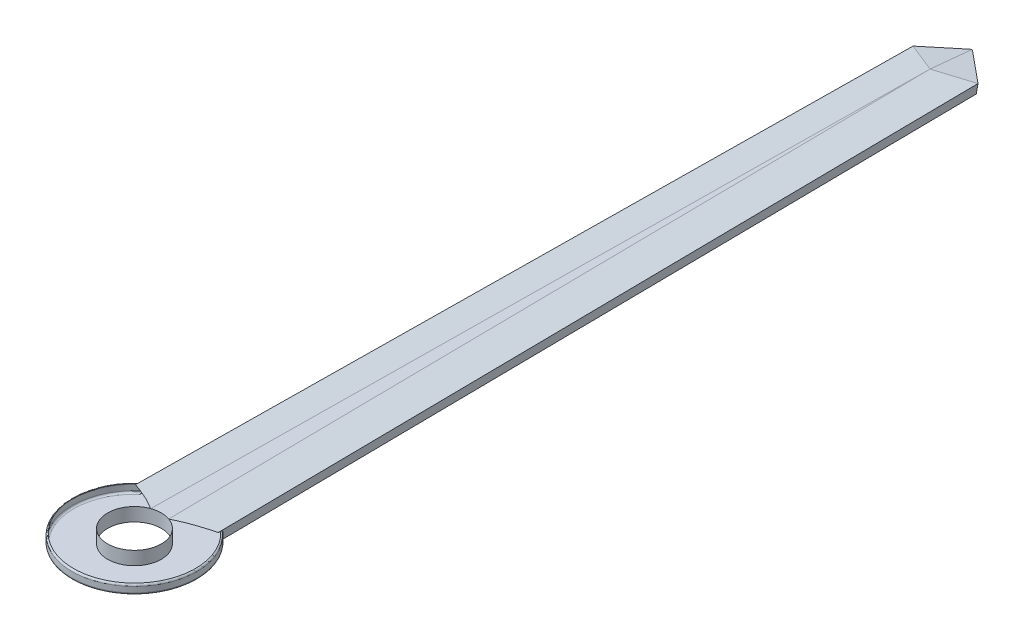
ISO-10303-21;
HEADER;
FILE_DESCRIPTION(('STEP AP214'),'2;1');
FILE_NAME('part.step','',(''),(''),'','','');
FILE_SCHEMA(('AUTOMOTIVE_DESIGN { 1 0 10303 214 1 1 1 1 }'));
ENDSEC;
DATA;
#1=APPLICATION_CONTEXT('core data for automotive mechanical design processes');
#2=APPLICATION_PROTOCOL_DEFINITION('international standard','automotive_design',2000,#1);
#3=PRODUCT_CONTEXT('',#1,'mechanical');
#4=PRODUCT('Part','Part','',(#3));
#5=PRODUCT_RELATED_PRODUCT_CATEGORY('part','',(#4));
#6=PRODUCT_DEFINITION_FORMATION('','',#4);
#7=PRODUCT_DEFINITION_CONTEXT('part definition',#1,'design');
#8=PRODUCT_DEFINITION('design','',#6,#7);
#9=PRODUCT_DEFINITION_SHAPE('','',#8);
#10=(LENGTH_UNIT() NAMED_UNIT(*) SI_UNIT(.MILLI.,.METRE.));
#11=(NAMED_UNIT(*) PLANE_ANGLE_UNIT() SI_UNIT($,.RADIAN.));
#12=(NAMED_UNIT(*) SI_UNIT($,.STERADIAN.) SOLID_ANGLE_UNIT());
#13=UNCERTAINTY_MEASURE_WITH_UNIT(LENGTH_MEASURE(1.E-05),#10,'distance_accuracy_value','');
#14=(GEOMETRIC_REPRESENTATION_CONTEXT(3) GLOBAL_UNCERTAINTY_ASSIGNED_CONTEXT((#13)) GLOBAL_UNIT_ASSIGNED_CONTEXT((#10,
#11,#12)) REPRESENTATION_CONTEXT('',''));
#15=CARTESIAN_POINT('',(0.,0.,0.));
#16=DIRECTION('',(0.,0.,1.));
#17=DIRECTION('',(1.,0.,0.));
#18=AXIS2_PLACEMENT_3D('',#15,#16,#17);
#19=CARTESIAN_POINT('',(0.,0.1905,0.));
#20=DIRECTION('',(0.,1.,0.));
#21=DIRECTION('',(0.,0.,1.));
#22=AXIS2_PLACEMENT_3D('',#19,#20,#21);
#23=PLANE('',#22);
#24=CARTESIAN_POINT('',(0.,0.1905,0.));
#25=DIRECTION('',(0.,1.,0.));
#26=DIRECTION('',(0.,0.,1.));
#27=AXIS2_PLACEMENT_3D('',#24,#25,#26);
#28=CIRCLE('',#27,0.380999999999999);
#29=CARTESIAN_POINT('',(0.127490264898993,0.1905,-0.359036533455837));
#30=VERTEX_POINT('',#29);
#31=CARTESIAN_POINT('',(-0.127490264898993,0.1905,-0.359036533455837));
#32=VERTEX_POINT('',#31);
#33=EDGE_CURVE('E142',#30,#32,#28,.T.);
#34=ORIENTED_EDGE('',*,*,#33,.F.);
#35=DIRECTION('',(-0.0116271209621439,0.,-0.999932402744371));
#36=VECTOR('',#35,1.);
#37=CARTESIAN_POINT('',(-0.00250040730988243,0.1905,-11.5382343434191));
#38=LINE('',#37,#36);
#39=CARTESIAN_POINT('',(0.000255235996342604,0.1905,-11.3012490190838));
#40=VERTEX_POINT('',#39);
#41=EDGE_CURVE('E173',#30,#40,#38,.T.);
#42=ORIENTED_EDGE('',*,*,#41,.T.);
#43=DIRECTION('',(-0.771288038730068,0.,-0.63648626168357));
#44=VECTOR('',#43,1.);
#45=CARTESIAN_POINT('',(-0.324948461460821,0.1905,-11.5696152782325));
#46=LINE('',#45,#44);
#47=CARTESIAN_POINT('',(0.,0.1905,-11.3014596462386));
#48=VERTEX_POINT('',#47);
#49=EDGE_CURVE('E170',#40,#48,#46,.T.);
#50=ORIENTED_EDGE('',*,*,#49,.T.);
#51=DIRECTION('',(-0.771288038730068,0.,0.63648626168357));
#52=VECTOR('',#51,1.);
#53=CARTESIAN_POINT('',(-0.183051538539177,0.1905,-11.1504009190061));
#54=LINE('',#53,#52);
#55=CARTESIAN_POINT('',(-0.000255235996342899,0.1905,-11.3012490190838));
#56=VERTEX_POINT('',#55);
#57=EDGE_CURVE('E168',#48,#56,#54,.T.);
#58=ORIENTED_EDGE('',*,*,#57,.T.);
#59=DIRECTION('',(-0.0116271209621439,0.,0.999932402744371));
#60=VECTOR('',#59,1.);
#61=CARTESIAN_POINT('',(-0.124499592690118,0.1905,-0.616234343419138));
#62=LINE('',#61,#60);
#63=EDGE_CURVE('E166',#56,#32,#62,.T.);
#64=ORIENTED_EDGE('',*,*,#63,.T.);
#65=EDGE_LOOP('',(#34,#42,#50,#58,#64));
#66=FACE_BOUND('',#65,.T.);
#67=ADVANCED_FACE('F32',(#66),#23,.T.);
#68=CARTESIAN_POINT('',(0.,0.,0.));
#69=DIRECTION('',(0.,1.,0.));
#70=DIRECTION('',(0.,0.,1.));
#71=AXIS2_PLACEMENT_3D('',#68,#69,#70);
#72=PLANE('',#71);
#73=DIRECTION('',(0.771288038730068,0.,-0.63648626168357));
#74=VECTOR('',#73,1.);
#75=CARTESIAN_POINT('',(-5.83257906208231,0.,-7.06786420437777));
#76=LINE('',#75,#74);
#77=CARTESIAN_POINT('',(-0.444847037542179,0.,-11.5139559924711));
#78=VERTEX_POINT('',#77);
#79=CARTESIAN_POINT('',(-0.0160431319088782,0.,-11.8678157454906));
#80=VERTEX_POINT('',#79);
#81=EDGE_CURVE('E137',#78,#80,#76,.T.);
#82=ORIENTED_EDGE('',*,*,#81,.T.);
#83=CARTESIAN_POINT('',(0.,0.,-11.8478692612338));
#84=DIRECTION('',(0.,1.,0.));
#85=DIRECTION('',(0.,0.,-1.));
#86=AXIS2_PLACEMENT_3D('',#83,#84,#85);
#87=ELLIPSE('',#86,0.0257281487250946,0.0254);
#88=CARTESIAN_POINT('',(0.0160431319088765,0.,-11.8678157454906));
#89=VERTEX_POINT('',#88);
#90=EDGE_CURVE('E303',#80,#89,#87,.F.);
#91=ORIENTED_EDGE('',*,*,#90,.T.);
#92=DIRECTION('',(0.771288038730068,0.,0.63648626168357));
#93=VECTOR('',#92,1.);
#94=CARTESIAN_POINT('',(5.83257906208231,0.,-7.06786420437777));
#95=LINE('',#94,#93);
#96=CARTESIAN_POINT('',(0.444847037542178,0.,-11.5139559924712));
#97=VERTEX_POINT('',#96);
#98=EDGE_CURVE('E159',#89,#97,#95,.T.);
#99=ORIENTED_EDGE('',*,*,#98,.T.);
#100=DIRECTION('',(0.0116271209621439,0.,0.999932402744371));
#101=VECTOR('',#100,1.);
#102=CARTESIAN_POINT('',(0.578652008248543,0.,-0.00672851172382027));
#103=LINE('',#102,#101);
#104=CARTESIAN_POINT('',(0.571198656038301,0.,-0.647716801804646));
#105=VERTEX_POINT('',#104);
#106=EDGE_CURVE('E161',#97,#105,#103,.T.);
#107=ORIENTED_EDGE('',*,*,#106,.T.);
#108=CARTESIAN_POINT('',(0.,0.,0.));
#109=DIRECTION('',(0.,1.,0.));
#110=DIRECTION('',(0.,0.,1.));
#111=AXIS2_PLACEMENT_3D('',#108,#109,#110);
#112=CIRCLE('',#111,0.8636);
#113=CARTESIAN_POINT('',(-0.571198656038301,0.,-0.647716801804646));
#114=VERTEX_POINT('',#113);
#115=EDGE_CURVE('E140',#105,#114,#112,.F.);
#116=ORIENTED_EDGE('',*,*,#115,.T.);
#117=DIRECTION('',(0.0116271209621439,0.,-0.999932402744371));
#118=VECTOR('',#117,1.);
#119=CARTESIAN_POINT('',(-0.578652008248543,0.,-0.00672851172382027));
#120=LINE('',#119,#118);
#121=EDGE_CURVE('E132',#114,#78,#120,.T.);
#122=ORIENTED_EDGE('',*,*,#121,.T.);
#123=EDGE_LOOP('',(#82,#91,#99,#107,#116,#122));
#124=FACE_BOUND('',#123,.T.);
#125=CARTESIAN_POINT('',(0.,0.,0.));
#126=DIRECTION('',(0.,1.,0.));
#127=DIRECTION('',(0.,0.,1.));
#128=AXIS2_PLACEMENT_3D('',#125,#126,#127);
#129=CIRCLE('',#128,0.380999999999999);
#130=CARTESIAN_POINT('',(0.,0.,0.380999999999999));
#131=VERTEX_POINT('',#130);
#132=EDGE_CURVE('E198',#131,#131,#129,.T.);
#133=ORIENTED_EDGE('',*,*,#132,.T.);
#134=EDGE_LOOP('',(#133));
#135=FACE_BOUND('',#134,.T.);
#136=ADVANCED_FACE('F134',(#124,#135),#72,.F.);
#137=CARTESIAN_POINT('',(0.,0.1905,0.));
#138=DIRECTION('',(0.,-1.,0.));
#139=DIRECTION('',(0.,0.,-1.));
#140=AXIS2_PLACEMENT_3D('',#137,#138,#139);
#141=CYLINDRICAL_SURFACE('',#140,0.889);
#142=CARTESIAN_POINT('',(0.,-4.65263034160604,0.));
#143=DIRECTION('',(-0.992286414925699,0.123428280262923,0.011538214127043));
#144=DIRECTION('',(-0.12341993684991,-0.992353495298595,0.0014351155447664));
#145=AXIS2_PLACEMENT_3D('',#142,#143,#144);
#146=ELLIPSE('',#145,7.20256328700588,0.889);
#147=CARTESIAN_POINT('',(0.573995985884059,0.0254000000000018,-0.678859048837818));
#148=VERTEX_POINT('',#147);
#149=CARTESIAN_POINT('',(0.583942218372925,0.10456351765091,-0.670322672749257));
#150=VERTEX_POINT('',#149);
#151=EDGE_CURVE('E175',#148,#150,#146,.F.);
#152=ORIENTED_EDGE('',*,*,#151,.T.);
#153=CARTESIAN_POINT('',(0.,0.104563517650909,0.));
#154=DIRECTION('',(0.,1.,0.));
#155=DIRECTION('',(0.,0.,1.));
#156=AXIS2_PLACEMENT_3D('',#153,#154,#155);
#157=CIRCLE('',#156,0.889);
#158=CARTESIAN_POINT('',(-0.583942218372925,0.104563517650912,-0.670322672749257));
#159=VERTEX_POINT('',#158);
#160=EDGE_CURVE('E300',#150,#159,#157,.F.);
#161=ORIENTED_EDGE('',*,*,#160,.T.);
#162=CARTESIAN_POINT('',(0.,-4.65263034160604,0.));
#163=DIRECTION('',(0.992286414925699,0.123428280262923,0.011538214127043));
#164=DIRECTION('',(0.12341993684991,-0.992353495298595,0.0014351155447664));
#165=AXIS2_PLACEMENT_3D('',#162,#163,#164);
#166=ELLIPSE('',#165,7.20256328700589,0.889);
#167=CARTESIAN_POINT('',(-0.573995985884059,0.0253999999999992,-0.678859048837818));
#168=VERTEX_POINT('',#167);
#169=EDGE_CURVE('E178',#159,#168,#166,.F.);
#170=ORIENTED_EDGE('',*,*,#169,.T.);
#171=CARTESIAN_POINT('',(0.,0.0254,0.));
#172=DIRECTION('',(0.,1.,0.));
#173=DIRECTION('',(0.,0.,1.));
#174=AXIS2_PLACEMENT_3D('',#171,#172,#173);
#175=CIRCLE('',#174,0.889);
#176=EDGE_CURVE('E302',#168,#148,#175,.T.);
#177=ORIENTED_EDGE('',*,*,#176,.T.);
#178=EDGE_LOOP('',(#152,#161,#170,#177));
#179=FACE_BOUND('',#178,.T.);
#180=ADVANCED_FACE('F277',(#179),#141,.T.);
#181=CARTESIAN_POINT('',(0.,0.1905,0.));
#182=DIRECTION('',(0.,-1.,0.));
#183=DIRECTION('',(0.,0.,-1.));
#184=AXIS2_PLACEMENT_3D('',#181,#182,#183);
#185=CYLINDRICAL_SURFACE('',#184,0.380999999999999);
#186=CARTESIAN_POINT('',(0.,0.190184708544504,0.));
#187=DIRECTION('',(0.,-1.,0.));
#188=DIRECTION('',(0.,0.,-1.));
#189=AXIS2_PLACEMENT_3D('',#186,#187,#188);
#190=CIRCLE('',#189,0.380999999999999);
#191=CARTESIAN_POINT('',(-0.130035983962558,0.190184708544504,-0.358122385330614));
#192=VERTEX_POINT('',#191);
#193=CARTESIAN_POINT('',(0.13003598396265,0.190184708544504,-0.358122385330581));
#194=VERTEX_POINT('',#193);
#195=EDGE_CURVE('E201',#192,#194,#190,.F.);
#196=ORIENTED_EDGE('',*,*,#195,.T.);
#197=CARTESIAN_POINT('',(0.,0.206875313262966,0.));
#198=DIRECTION('',(0.123419936849913,0.992353495298594,-0.00143511554476643));
#199=DIRECTION('',(0.992286414925698,-0.123428280262926,-0.011538214127043));
#200=AXIS2_PLACEMENT_3D('',#197,#198,#199);
#201=ELLIPSE('',#200,0.383935766644686,0.380999999999999);
#202=EDGE_CURVE('E204',#194,#30,#201,.T.);
#203=ORIENTED_EDGE('',*,*,#202,.T.);
#204=ORIENTED_EDGE('',*,*,#33,.T.);
#205=CARTESIAN_POINT('',(0.,0.206875313262966,0.));
#206=DIRECTION('',(-0.123419936849913,0.992353495298594,-0.00143511554476643));
#207=DIRECTION('',(-0.992286414925698,-0.123428280262926,-0.011538214127043));
#208=AXIS2_PLACEMENT_3D('',#205,#206,#207);
#209=ELLIPSE('',#208,0.383935766644686,0.380999999999999);
#210=EDGE_CURVE('E181',#32,#192,#209,.T.);
#211=ORIENTED_EDGE('',*,*,#210,.T.);
#212=EDGE_LOOP('',(#196,#203,#204,#211));
#213=FACE_BOUND('',#212,.T.);
#214=ORIENTED_EDGE('',*,*,#132,.F.);
#215=EDGE_LOOP('',(#214));
#216=FACE_BOUND('',#215,.T.);
#217=ADVANCED_FACE('F281',(#213,#216),#185,.F.);
#218=CARTESIAN_POINT('',(-0.131647308512932,0.1905,-0.00153078265712711));
#219=DIRECTION('',(-0.123419936849913,0.992353495298594,-0.00143511554476643));
#220=DIRECTION('',(-0.992354517204281,-0.123420063945284,0.));
#221=AXIS2_PLACEMENT_3D('',#218,#219,#220);
#222=PLANE('',#221);
#223=DIRECTION('',(-0.0116271209621439,0.,0.999932402744371));
#224=VECTOR('',#223,1.);
#225=CARTESIAN_POINT('',(-0.588026098472768,0.132842978192118,-0.621624186509634));
#226=LINE('',#225,#224);
#227=CARTESIAN_POINT('',(-0.588248862316324,0.132842978192118,-0.602466495963819));
#228=VERTEX_POINT('',#227);
#229=CARTESIAN_POINT('',(-0.461279660106525,0.132842978192118,-11.5218178860066));
#230=VERTEX_POINT('',#229);
#231=EDGE_CURVE('E149',#228,#230,#226,.F.);
#232=ORIENTED_EDGE('',*,*,#231,.F.);
#233=CARTESIAN_POINT('',(-0.588248862316324,0.132842978192118,-0.602466495963819));
#234=CARTESIAN_POINT('',(-0.548193220507443,0.137849566828459,-0.585296484566291));
#235=CARTESIAN_POINT('',(-0.508362668731256,0.142828974169535,-0.567564048589156));
#236=CARTESIAN_POINT('',(-0.429495899396567,0.15269108663912,-0.530654066274168));
#237=CARTESIAN_POINT('',(-0.390457882077916,0.157574009984259,-0.511480406905702));
#238=CARTESIAN_POINT('',(-0.313215901142291,0.167238871748706,-0.4712335121522));
#239=CARTESIAN_POINT('',(-0.27501417868527,0.172020537903475,-0.450155802456047));
#240=CARTESIAN_POINT('',(-0.200026951377842,0.181411521945662,-0.405381024593189));
#241=CARTESIAN_POINT('',(-0.163245533047501,0.186020341559049,-0.381677062156839));
#242=CARTESIAN_POINT('',(-0.127521687784073,0.190500000000005,-0.356334165335821));
#243=B_SPLINE_CURVE_WITH_KNOTS('',3,(#233,#234,#235,#236,#237,#238,#239,#240,#241,#242),
.UNSPECIFIED.,.F.,.F.,(4,2,2,2,4),(0.,0.131612085498327,0.262881139686943,0.394467111305991,
0.526407086773529),.UNSPECIFIED.);
#244=EDGE_CURVE('E315',#228,#192,#243,.T.);
#245=ORIENTED_EDGE('',*,*,#244,.T.);
#246=ORIENTED_EDGE('',*,*,#210,.F.);
#247=ORIENTED_EDGE('',*,*,#63,.F.);
#248=DIRECTION('',(-0.896387779973205,-0.112104797653588,-0.428860655991847));
#249=VECTOR('',#248,1.);
#250=CARTESIAN_POINT('',(4.23806906466026,0.72055685567199,-9.27349877471953));
#251=LINE('',#250,#249);
#252=EDGE_CURVE('E195',#230,#56,#251,.F.);
#253=ORIENTED_EDGE('',*,*,#252,.F.);
#254=EDGE_LOOP('',(#232,#245,#246,#247,#253));
#255=FACE_BOUND('',#254,.T.);
#256=ADVANCED_FACE('F319',(#255),#222,.T.);
#257=CARTESIAN_POINT('',(-5.5480474782384,0.1905,-6.72307151917629));
#258=DIRECTION('',(-0.0785604046905817,0.992353495298594,-0.0951987562078173));
#259=DIRECTION('',(0.,0.0954938938986421,0.995430015735951));
#260=AXIS2_PLACEMENT_3D('',#257,#258,#259);
#261=PLANE('',#260);
#262=DIRECTION('',(0.,-0.0954938938986422,-0.99543001573595));
#263=VECTOR('',#262,1.);
#264=CARTESIAN_POINT('',(0.,0.625710075849527,-6.76482222404737));
#265=LINE('',#264,#263);
#266=CARTESIAN_POINT('',(0.,0.133547497242996,-11.8951335284219));
#267=VERTEX_POINT('',#266);
#268=EDGE_CURVE('E192',#267,#48,#265,.F.);
#269=ORIENTED_EDGE('',*,*,#268,.F.);
#270=CARTESIAN_POINT('',(0.,0.135978056510796,-11.8697973362172));
#271=DIRECTION('',(-0.0785604046905817,0.992353495298594,-0.0951987562078173));
#272=DIRECTION('',(0.771288038730088,0.,-0.636486261683545));
#273=AXIS2_PLACEMENT_3D('',#270,#271,#272);
#274=ELLIPSE('',#273,0.0255314183149097,0.0254);
#275=CARTESIAN_POINT('',(-0.0160431319088771,0.132842978192118,-11.8892382518975));
#276=VERTEX_POINT('',#275);
#277=EDGE_CURVE('E309',#267,#276,#274,.T.);
#278=ORIENTED_EDGE('',*,*,#277,.T.);
#279=DIRECTION('',(-0.771288038730068,0.,0.63648626168357));
#280=VECTOR('',#279,1.);
#281=CARTESIAN_POINT('',(-0.478099735844441,0.132842978192118,-11.5079375370448));
#282=LINE('',#281,#280);
#283=EDGE_CURVE('E153',#230,#276,#282,.F.);
#284=ORIENTED_EDGE('',*,*,#283,.F.);
#285=ORIENTED_EDGE('',*,*,#252,.T.);
#286=ORIENTED_EDGE('',*,*,#57,.F.);
#287=EDGE_LOOP('',(#269,#278,#284,#285,#286));
#288=FACE_BOUND('',#287,.T.);
#289=ADVANCED_FACE('F240',(#288),#261,.T.);
#290=CARTESIAN_POINT('',(-0.635,0.510534918069288,-0.622170394666927));
#291=DIRECTION('',(0.992286414925699,0.123428280262923,0.011538214127043));
#292=DIRECTION('',(-0.123436497110616,0.992352473257895,0.));
#293=AXIS2_PLACEMENT_3D('',#290,#291,#292);
#294=PLANE('',#293);
#295=ORIENTED_EDGE('',*,*,#169,.F.);
#296=CARTESIAN_POINT('',(-0.583942218372925,0.104563517650909,-0.670322672749257));
#297=CARTESIAN_POINT('',(-0.584104249927129,0.105853117583221,-0.670183257053217));
#298=CARTESIAN_POINT('',(-0.584265342745076,0.107122761098843,-0.669911091961102));
#299=CARTESIAN_POINT('',(-0.584580049900082,0.109580953005702,-0.669142408447812));
#300=CARTESIAN_POINT('',(-0.584733719672291,0.110770143439963,-0.668647990760664));
#301=CARTESIAN_POINT('',(-0.585030417453713,0.113045736475916,-0.667474789891916));
#302=CARTESIAN_POINT('',(-0.585173493052339,0.11413260555371,-0.666796904077463));
#303=CARTESIAN_POINT('',(-0.585448283233792,0.116200939100631,-0.665290630133141));
#304=CARTESIAN_POINT('',(-0.585579966831143,0.117182117770456,-0.664461849459796));
#305=CARTESIAN_POINT('',(-0.585892627948483,0.119488657882759,-0.662246853316463));
#306=CARTESIAN_POINT('',(-0.586065857048017,0.120744880618033,-0.660787401263488));
#307=CARTESIAN_POINT('',(-0.586383512277623,0.12300849941694,-0.657683767282133));
#308=CARTESIAN_POINT('',(-0.586527875948282,0.12401535699983,-0.656039196547951));
#309=CARTESIAN_POINT('',(-0.586826626763701,0.126050538582397,-0.652117670016126));
#310=CARTESIAN_POINT('',(-0.586971339698861,0.126997056242895,-0.649797585447162));
#311=CARTESIAN_POINT('',(-0.587213829203313,0.128501539785394,-0.645037470572332));
#312=CARTESIAN_POINT('',(-0.587311663284962,0.129059982150471,-0.6425975913086));
#313=CARTESIAN_POINT('',(-0.587414829502616,0.129570068732687,-0.639181869759658));
#314=CARTESIAN_POINT('',(-0.587440036875009,0.12968364766395,-0.638229028973402));
#315=CARTESIAN_POINT('',(-0.587461793826662,0.129769296430835,-0.637274145710641));
#316=B_SPLINE_CURVE_WITH_KNOTS('',3,(#296,#297,#298,#299,#300,#301,#302,#303,#304,#305,#306,
#307,#308,#309,#310,#311,#312,#313,#314,#315),.UNSPECIFIED.,.F.,.F.,(4,2,2,2,2,2,2,2,2,4),(0.,
0.00390675921132828,0.00777734379610161,0.0116293286702409,0.0154914812627117,0.021259819248556,
0.027040506893482,0.0345317102156363,0.0420136994279959,0.044891536435234),.UNSPECIFIED.);
#317=CARTESIAN_POINT('',(-0.587461793826662,0.129769296430836,-0.637274145710624));
#318=VERTEX_POINT('',#317);
#319=EDGE_CURVE('E60',#159,#318,#316,.T.);
#320=ORIENTED_EDGE('',*,*,#319,.T.);
#321=CARTESIAN_POINT('',(-0.586761723930837,0.126999999999996,-0.667856031888394));
#322=CARTESIAN_POINT('',(-0.58701258294032,0.127998178635317,-0.656960020301663));
#323=CARTESIAN_POINT('',(-0.587261940639642,0.128984182785995,-0.646062886702011));
#324=CARTESIAN_POINT('',(-0.587757653435011,0.130931842185044,-0.624266374727307));
#325=CARTESIAN_POINT('',(-0.588004008530851,0.13189349743174,-0.613366996352101));
#326=CARTESIAN_POINT('',(-0.588248862316324,0.132842978192118,-0.602466495963819));
#327=B_SPLINE_CURVE_WITH_KNOTS('',3,(#321,#322,#323,#324,#325,#326),.UNSPECIFIED.,.F.,.F.,(4,2,
4),(0.,0.0328334758626683,0.0656669539835402),.UNSPECIFIED.);
#328=EDGE_CURVE('E243',#318,#228,#327,.T.);
#329=ORIENTED_EDGE('',*,*,#328,.T.);
#330=ORIENTED_EDGE('',*,*,#231,.T.);
#331=DIRECTION('',(0.122552715498221,-0.990728512662257,0.0586331486622009));
#332=VECTOR('',#331,1.);
#333=CARTESIAN_POINT('',(-0.431425747715019,-0.10849906062395,-11.5075348170735));
#334=LINE('',#333,#332);
#335=EDGE_CURVE('E146',#78,#230,#334,.F.);
#336=ORIENTED_EDGE('',*,*,#335,.F.);
#337=ORIENTED_EDGE('',*,*,#121,.F.);
#338=CARTESIAN_POINT('',(-0.571198656038301,0.,-0.647716801804646));
#339=CARTESIAN_POINT('',(-0.571173985481209,1.23472504545118E-06,-0.649851677996783));
#340=CARTESIAN_POINT('',(-0.571167424126858,0.000148735256892394,-0.651993818842631));
#341=CARTESIAN_POINT('',(-0.571194916383691,0.000767562435153503,-0.656249293813108));
#342=CARTESIAN_POINT('',(-0.571229335994081,0.00124179104113898,-0.658362195274561));
#343=CARTESIAN_POINT('',(-0.571331697233564,0.0024085772214167,-0.662040645322824));
#344=CARTESIAN_POINT('',(-0.571391019168623,0.00303383097806176,-0.663627515304839));
#345=CARTESIAN_POINT('',(-0.571540624321738,0.00452200713404006,-0.666681008872747));
#346=CARTESIAN_POINT('',(-0.571630810317335,0.0053841815676792,-0.668147992341435));
#347=CARTESIAN_POINT('',(-0.571821781332556,0.00714969432872987,-0.670610787668139));
#348=CARTESIAN_POINT('',(-0.571916314353619,0.00800595859600489,-0.671640703846419));
#349=CARTESIAN_POINT('',(-0.572126406192652,0.00987320945937861,-0.673547436108814));
#350=CARTESIAN_POINT('',(-0.572241942151081,0.0108840276511603,-0.674424416634072));
#351=CARTESIAN_POINT('',(-0.572473946009436,0.012883518496956,-0.675861332213842));
#352=CARTESIAN_POINT('',(-0.572587628248466,0.01385240366094,-0.676449160458318));
#353=CARTESIAN_POINT('',(-0.572827391264135,0.0158738370221022,-0.677453515210049));
#354=CARTESIAN_POINT('',(-0.572953463101079,0.0169263247923461,-0.677870164123105));
#355=CARTESIAN_POINT('',(-0.57322821264777,0.01919795402351,-0.678542109245978));
#356=CARTESIAN_POINT('',(-0.573377885937935,0.0204231663936128,-0.678776728161864));
#357=CARTESIAN_POINT('',(-0.573683739734442,0.0229032812319451,-0.679003950684685));
#358=CARTESIAN_POINT('',(-0.573839956844846,0.0241583268090005,-0.678994937226952));
#359=CARTESIAN_POINT('',(-0.573995985881224,0.0253999999827562,-0.678859048897214));
#360=B_SPLINE_CURVE_WITH_KNOTS('',3,(#338,#339,#340,#341,#342,#343,#344,#345,#346,#347,#348,
#349,#350,#351,#352,#353,#354,#355,#356,#357,#358,#359),.UNSPECIFIED.,.F.,.F.,(4,2,2,2,2,2,2,2,
2,2,4),(0.,0.00641153917337711,0.0128807716605205,0.0179830909363638,0.0230694835189735,
0.0270826019222974,0.0310913783286584,0.0344936441983647,0.0378934729457264,0.0416384890004196,
0.0454083679706358),.UNSPECIFIED.);
#361=EDGE_CURVE('E11',#114,#168,#360,.T.);
#362=ORIENTED_EDGE('',*,*,#361,.T.);
#363=EDGE_LOOP('',(#295,#320,#329,#330,#336,#337,#362));
#364=FACE_BOUND('',#363,.T.);
#365=ADVANCED_FACE('F147',(#364),#294,.F.);
#366=CARTESIAN_POINT('',(5.5480474782384,0.1905,-6.72307151917629));
#367=DIRECTION('',(0.0785604046905819,0.992353495298594,-0.0951987562078176));
#368=DIRECTION('',(0.,0.0954938938986423,0.995430015735951));
#369=AXIS2_PLACEMENT_3D('',#366,#367,#368);
#370=PLANE('',#369);
#371=DIRECTION('',(-0.771288038730068,0.,-0.63648626168357));
#372=VECTOR('',#371,1.);
#373=CARTESIAN_POINT('',(-0.0299002641555591,0.132842978192118,-11.9271518962712));
#374=LINE('',#373,#372);
#375=CARTESIAN_POINT('',(0.0160431319088775,0.132842978192118,-11.8892382518975));
#376=VERTEX_POINT('',#375);
#377=CARTESIAN_POINT('',(0.461279660106525,0.132842978192118,-11.5218178860066));
#378=VERTEX_POINT('',#377);
#379=EDGE_CURVE('E187',#376,#378,#374,.F.);
#380=ORIENTED_EDGE('',*,*,#379,.F.);
#381=CARTESIAN_POINT('',(0.,0.135978056510797,-11.8697973362172));
#382=DIRECTION('',(0.0785604046905819,0.992353495298594,-0.0951987562078176));
#383=DIRECTION('',(-0.771288038730095,0.,-0.636486261683536));
#384=AXIS2_PLACEMENT_3D('',#381,#382,#383);
#385=ELLIPSE('',#384,0.0255314183149097,0.0254);
#386=EDGE_CURVE('E311',#376,#267,#385,.T.);
#387=ORIENTED_EDGE('',*,*,#386,.T.);
#388=ORIENTED_EDGE('',*,*,#268,.T.);
#389=ORIENTED_EDGE('',*,*,#49,.F.);
#390=DIRECTION('',(0.896387779973206,-0.112104797653588,-0.428860655991844));
#391=VECTOR('',#390,1.);
#392=CARTESIAN_POINT('',(2.69799966558342,-0.146887568368004,-12.5919364555029));
#393=LINE('',#392,#391);
#394=EDGE_CURVE('E154',#378,#40,#393,.F.);
#395=ORIENTED_EDGE('',*,*,#394,.F.);
#396=EDGE_LOOP('',(#380,#387,#388,#389,#395));
#397=FACE_BOUND('',#396,.T.);
#398=ADVANCED_FACE('F234',(#397),#370,.T.);
#399=CARTESIAN_POINT('',(-0.508,0.510534918069288,-11.5441703946669));
#400=DIRECTION('',(0.631619366491226,0.123428280262923,0.76539038111578));
#401=DIRECTION('',(0.771288038730068,0.,-0.63648626168357));
#402=AXIS2_PLACEMENT_3D('',#399,#400,#401);
#403=PLANE('',#402);
#404=ORIENTED_EDGE('',*,*,#283,.T.);
#405=DIRECTION('',(0.,-0.987245536839792,0.159205056420677));
#406=VECTOR('',#405,1.);
#407=CARTESIAN_POINT('',(-0.0160431319088775,0.446725982236157,-11.9398556105014));
#408=LINE('',#407,#406);
#409=EDGE_CURVE('E158',#276,#80,#408,.T.);
#410=ORIENTED_EDGE('',*,*,#409,.T.);
#411=ORIENTED_EDGE('',*,*,#81,.F.);
#412=ORIENTED_EDGE('',*,*,#335,.T.);
#413=EDGE_LOOP('',(#404,#410,#411,#412));
#414=FACE_BOUND('',#413,.T.);
#415=ADVANCED_FACE('F156',(#414),#403,.F.);
#416=CARTESIAN_POINT('',(0.131647308512932,0.1905,-0.00153078265712711));
#417=DIRECTION('',(0.123419936849913,0.992353495298594,-0.00143511554476643));
#418=DIRECTION('',(-0.992354517204281,0.123420063945284,0.));
#419=AXIS2_PLACEMENT_3D('',#416,#417,#418);
#420=PLANE('',#419);
#421=ORIENTED_EDGE('',*,*,#41,.F.);
#422=ORIENTED_EDGE('',*,*,#202,.F.);
#423=CARTESIAN_POINT('',(0.12752168778411,0.1905,-0.356334165335732));
#424=CARTESIAN_POINT('',(0.179523864309788,0.183979439635741,-0.392983148835548));
#425=CARTESIAN_POINT('',(0.233528599182533,0.177214511526552,-0.426387488425012));
#426=CARTESIAN_POINT('',(0.344031744034589,0.163381590620062,-0.488303236401294));
#427=CARTESIAN_POINT('',(0.400521244071694,0.156314682916234,-0.516830579535874));
#428=CARTESIAN_POINT('',(0.479249261012418,0.146469448175179,-0.554002658378174));
#429=CARTESIAN_POINT('',(0.500910347290855,0.143761029718878,-0.563966052133203));
#430=CARTESIAN_POINT('',(0.544436428431832,0.138319396069531,-0.583503145451653));
#431=CARTESIAN_POINT('',(0.566301637923232,0.135586154884375,-0.593076359953089));
#432=CARTESIAN_POINT('',(0.58824886231639,0.13284297819211,-0.602466495963848));
#433=B_SPLINE_CURVE_WITH_KNOTS('',3,(#423,#424,#425,#426,#427,#428,#429,#430,#431,#432),
.UNSPECIFIED.,.F.,.F.,(4,2,2,2,4),(0.,0.191458446972412,0.382278857510023,0.454267917685656,
0.526343901008368),.UNSPECIFIED.);
#434=CARTESIAN_POINT('',(0.588248862316322,0.132842978192118,-0.602466495963993));
#435=VERTEX_POINT('',#434);
#436=EDGE_CURVE('E207',#194,#435,#433,.T.);
#437=ORIENTED_EDGE('',*,*,#436,.T.);
#438=DIRECTION('',(-0.0116271209621439,0.,-0.999932402744371));
#439=VECTOR('',#438,1.);
#440=CARTESIAN_POINT('',(0.461026098472768,0.132842978192118,-11.5436241865096));
#441=LINE('',#440,#439);
#442=EDGE_CURVE('E185',#378,#435,#441,.F.);
#443=ORIENTED_EDGE('',*,*,#442,.F.);
#444=ORIENTED_EDGE('',*,*,#394,.T.);
#445=EDGE_LOOP('',(#421,#422,#437,#443,#444));
#446=FACE_BOUND('',#445,.T.);
#447=ADVANCED_FACE('F225',(#446),#420,.T.);
#448=CARTESIAN_POINT('',(0.,0.510534918069288,-11.9633847538934));
#449=DIRECTION('',(-0.631619366491226,0.123428280262922,0.765390381115781));
#450=DIRECTION('',(0.771288038730068,0.,0.63648626168357));
#451=AXIS2_PLACEMENT_3D('',#448,#449,#450);
#452=PLANE('',#451);
#453=ORIENTED_EDGE('',*,*,#98,.F.);
#454=DIRECTION('',(0.,-0.987245536839792,0.159205056420677));
#455=VECTOR('',#454,1.);
#456=CARTESIAN_POINT('',(0.0160431319088772,0.512615781740341,-11.9504811224497));
#457=LINE('',#456,#455);
#458=EDGE_CURVE('E313',#89,#376,#457,.F.);
#459=ORIENTED_EDGE('',*,*,#458,.T.);
#460=ORIENTED_EDGE('',*,*,#379,.T.);
#461=DIRECTION('',(-0.122552715498221,-0.990728512662257,0.0586331486621997));
#462=VECTOR('',#461,1.);
#463=CARTESIAN_POINT('',(0.503382590942968,0.473207317543837,-11.54196127812));
#464=LINE('',#463,#462);
#465=EDGE_CURVE('E182',#97,#378,#464,.F.);
#466=ORIENTED_EDGE('',*,*,#465,.F.);
#467=EDGE_LOOP('',(#453,#459,#460,#466));
#468=FACE_BOUND('',#467,.T.);
#469=ADVANCED_FACE('F230',(#468),#452,.F.);
#470=CARTESIAN_POINT('',(0.508,0.510534918069288,-11.5441703946669));
#471=DIRECTION('',(-0.992286414925699,0.123428280262923,0.011538214127043));
#472=DIRECTION('',(-0.123436497110616,-0.992352473257895,0.));
#473=AXIS2_PLACEMENT_3D('',#470,#471,#472);
#474=PLANE('',#473);
#475=ORIENTED_EDGE('',*,*,#151,.F.);
#476=CARTESIAN_POINT('',(0.573995985884059,0.0254,-0.678859048837818));
#477=CARTESIAN_POINT('',(0.573858614463925,0.0243066949276383,-0.678977527234792));
#478=CARTESIAN_POINT('',(0.573721079368415,0.0232030134282763,-0.678999081473847));
#479=CARTESIAN_POINT('',(0.573450269253389,0.0210120665416885,-0.678851432264446));
#480=CARTESIAN_POINT('',(0.57331698049174,0.0199247558748869,-0.678682926268013));
#481=CARTESIAN_POINT('',(0.573058068766036,0.0177942742207744,-0.678158833150036));
#482=CARTESIAN_POINT('',(0.572932452849961,0.0167511440777955,-0.677803076828158));
#483=CARTESIAN_POINT('',(0.572692266004709,0.0147378799519829,-0.67692256056593));
#484=CARTESIAN_POINT('',(0.572577698223088,0.0137677667884891,-0.676397752647394));
#485=CARTESIAN_POINT('',(0.572360265568612,0.0119073525967855,-0.675195464762214));
#486=CARTESIAN_POINT('',(0.572257583744161,0.0110183357882597,-0.674515980376457));
#487=CARTESIAN_POINT('',(0.572066752669052,0.00934584964164512,-0.673036288174918));
#488=CARTESIAN_POINT('',(0.571978612818721,0.00856244863584311,-0.672236002905154));
#489=CARTESIAN_POINT('',(0.571779938113091,0.00677032237312034,-0.67015103109142));
#490=CARTESIAN_POINT('',(0.571677677101408,0.00582308393554493,-0.668812539838825));
#491=CARTESIAN_POINT('',(0.571502952062893,0.00415535246470472,-0.665998590906806));
#492=CARTESIAN_POINT('',(0.57143055914319,0.00343540148101112,-0.664522816506595));
#493=CARTESIAN_POINT('',(0.571294391968452,0.00201050713227311,-0.66099060424902));
#494=CARTESIAN_POINT('',(0.571241055841017,0.00138640417116661,-0.658901265270516));
#495=CARTESIAN_POINT('',(0.571177808115013,0.000480809591655116,-0.654653110249635));
#496=CARTESIAN_POINT('',(0.571167870533442,0.000199113045151655,-0.652494336558481));
#497=CARTESIAN_POINT('',(0.571181480540977,2.47222675849728E-05,-0.649458357249416));
#498=CARTESIAN_POINT('',(0.5711885494495,1.20562527707044E-07,-0.648587258140736));
#499=CARTESIAN_POINT('',(0.571198656038301,0.,-0.647716801804646));
#500=B_SPLINE_CURVE_WITH_KNOTS('',3,(#476,#477,#478,#479,#480,#481,#482,#483,#484,#485,#486,
#487,#488,#489,#490,#491,#492,#493,#494,#495,#496,#497,#498,#499),.UNSPECIFIED.,.F.,.F.,(4,2,2,
2,2,2,2,2,2,2,2,4),(0.,0.00332060818450834,0.00662907047593216,0.00994052745581145,
0.013252925082769,0.0166109736180634,0.0199711844536158,0.0248727990797086,0.0297860165932265,
0.0362951964884905,0.0428004787590775,0.0454131118642467),.UNSPECIFIED.);
#501=EDGE_CURVE('E45',#148,#105,#500,.T.);
#502=ORIENTED_EDGE('',*,*,#501,.T.);
#503=ORIENTED_EDGE('',*,*,#106,.F.);
#504=ORIENTED_EDGE('',*,*,#465,.T.);
#505=ORIENTED_EDGE('',*,*,#442,.T.);
#506=CARTESIAN_POINT('',(0.588248862316322,0.132842978192118,-0.602466495963993));
#507=CARTESIAN_POINT('',(0.588004008530849,0.131893497431734,-0.613366996352246));
#508=CARTESIAN_POINT('',(0.587757653435008,0.130931842185036,-0.624266374727422));
#509=CARTESIAN_POINT('',(0.58726194063964,0.128984182785987,-0.646062886702068));
#510=CARTESIAN_POINT('',(0.587012582940319,0.127998178635312,-0.656960020301692));
#511=CARTESIAN_POINT('',(0.586761723930838,0.126999999999996,-0.667856031888394));
#512=B_SPLINE_CURVE_WITH_KNOTS('',3,(#506,#507,#508,#509,#510,#511),.UNSPECIFIED.,.F.,.F.,(4,2,
4),(0.,0.0328334781207852,0.0656669539833668),.UNSPECIFIED.);
#513=CARTESIAN_POINT('',(0.587461793826734,0.129769296431119,-0.637274145707469));
#514=VERTEX_POINT('',#513);
#515=EDGE_CURVE('E215',#435,#514,#512,.T.);
#516=ORIENTED_EDGE('',*,*,#515,.T.);
#517=CARTESIAN_POINT('',(0.58746179382236,0.129769296431494,-0.637274145707403));
#518=CARTESIAN_POINT('',(0.587401920930439,0.129532475161845,-0.639889855359205));
#519=CARTESIAN_POINT('',(0.587316422873098,0.129088601265363,-0.642494415295554));
#520=CARTESIAN_POINT('',(0.58709261066205,0.127767631513364,-0.64761139370623));
#521=CARTESIAN_POINT('',(0.58695385648256,0.126886907997167,-0.650122848051625));
#522=CARTESIAN_POINT('',(0.586665596761128,0.124961472514371,-0.654316132597006));
#523=CARTESIAN_POINT('',(0.586528079906473,0.124017534843586,-0.656044953292311));
#524=CARTESIAN_POINT('',(0.586223075351222,0.12187255851562,-0.659329788962793));
#525=CARTESIAN_POINT('',(0.586055666881845,0.120672197924436,-0.66088624356041));
#526=CARTESIAN_POINT('',(0.585735243626367,0.11833162406067,-0.663404712733941));
#527=CARTESIAN_POINT('',(0.585588575489816,0.117247354791737,-0.664419367867698));
#528=CARTESIAN_POINT('',(0.58527949731923,0.114934622335843,-0.666259988942266));
#529=CARTESIAN_POINT('',(0.585117142322078,0.113706660302976,-0.667086582730375));
#530=CARTESIAN_POINT('',(0.584790055048169,0.11120482901971,-0.668453130917027));
#531=CARTESIAN_POINT('',(0.584626198241146,0.109939437771753,-0.669008487052457));
#532=CARTESIAN_POINT('',(0.584289429923708,0.107312552293009,-0.669869856860081));
#533=CARTESIAN_POINT('',(0.584116436960376,0.105950132949105,-0.670172979227055));
#534=CARTESIAN_POINT('',(0.583942218372925,0.104563517650909,-0.670322672749257));
#535=B_SPLINE_CURVE_WITH_KNOTS('',3,(#517,#518,#519,#520,#521,#522,#523,#524,#525,#526,#527,
#528,#529,#530,#531,#532,#533,#534),.UNSPECIFIED.,.F.,.F.,(4,2,2,2,2,2,2,2,4),(0.,
0.00788663899635556,0.0158398946908899,0.0217432585618111,0.0276312010853114,0.0320919829161533,
0.0365376463412517,0.0406877832856139,0.0448848614950803),.UNSPECIFIED.);
#536=EDGE_CURVE('E254',#514,#150,#535,.T.);
#537=ORIENTED_EDGE('',*,*,#536,.T.);
#538=EDGE_LOOP('',(#475,#502,#503,#504,#505,#516,#537));
#539=FACE_BOUND('',#538,.T.);
#540=ADVANCED_FACE('F270',(#539),#474,.F.);
#541=CARTESIAN_POINT('',(0.,0.1905,0.));
#542=DIRECTION('',(0.,-1.,0.));
#543=DIRECTION('',(0.,0.,-1.));
#544=AXIS2_PLACEMENT_3D('',#541,#542,#543);
#545=CONICAL_SURFACE('',#544,0.378465081930712,1.4470524828285);
#546=ORIENTED_EDGE('',*,*,#328,.F.);
#547=CARTESIAN_POINT('',(0.,0.129769296431494,0.));
#548=DIRECTION('',(0.,-1.,0.));
#549=DIRECTION('',(0.,0.,-1.));
#550=AXIS2_PLACEMENT_3D('',#547,#548,#549);
#551=CIRCLE('',#550,0.866735078318678);
#552=EDGE_CURVE('E52',#318,#514,#551,.F.);
#553=ORIENTED_EDGE('',*,*,#552,.T.);
#554=ORIENTED_EDGE('',*,*,#515,.F.);
#555=ORIENTED_EDGE('',*,*,#436,.F.);
#556=ORIENTED_EDGE('',*,*,#195,.F.);
#557=ORIENTED_EDGE('',*,*,#244,.F.);
#558=EDGE_LOOP('',(#546,#553,#554,#555,#556,#557));
#559=FACE_BOUND('',#558,.T.);
#560=ADVANCED_FACE('F221',(#559),#545,.T.);
#561=CARTESIAN_POINT('',(0.,0.51575086005902,-11.9310402067694));
#562=DIRECTION('',(0.,0.987245536839792,-0.159205056420677));
#563=DIRECTION('',(0.,0.159205056420677,0.987245536839792));
#564=AXIS2_PLACEMENT_3D('',#561,#562,#563);
#565=CYLINDRICAL_SURFACE('',#564,0.0254);
#566=ORIENTED_EDGE('',*,*,#90,.F.);
#567=ORIENTED_EDGE('',*,*,#409,.F.);
#568=ORIENTED_EDGE('',*,*,#277,.F.);
#569=ORIENTED_EDGE('',*,*,#386,.F.);
#570=ORIENTED_EDGE('',*,*,#458,.F.);
#571=EDGE_LOOP('',(#566,#567,#568,#569,#570));
#572=FACE_BOUND('',#571,.T.);
#573=ADVANCED_FACE('F262',(#572),#565,.T.);
#574=CARTESIAN_POINT('',(0.,0.104563517650909,0.));
#575=DIRECTION('',(0.,1.,0.));
#576=DIRECTION('',(0.,0.,1.));
#577=AXIS2_PLACEMENT_3D('',#574,#575,#576);
#578=TOROIDAL_SURFACE('',#577,0.8636,0.0254);
#579=ORIENTED_EDGE('',*,*,#536,.F.);
#580=ORIENTED_EDGE('',*,*,#552,.F.);
#581=ORIENTED_EDGE('',*,*,#319,.F.);
#582=ORIENTED_EDGE('',*,*,#160,.F.);
#583=EDGE_LOOP('',(#579,#580,#581,#582));
#584=FACE_BOUND('',#583,.T.);
#585=ADVANCED_FACE('F259',(#584),#578,.T.);
#586=CARTESIAN_POINT('',(0.,0.0254,0.));
#587=DIRECTION('',(0.,1.,0.));
#588=DIRECTION('',(0.,0.,1.));
#589=AXIS2_PLACEMENT_3D('',#586,#587,#588);
#590=TOROIDAL_SURFACE('',#589,0.8636,0.0254);
#591=ORIENTED_EDGE('',*,*,#361,.F.);
#592=ORIENTED_EDGE('',*,*,#115,.F.);
#593=ORIENTED_EDGE('',*,*,#501,.F.);
#594=ORIENTED_EDGE('',*,*,#176,.F.);
#595=EDGE_LOOP('',(#591,#592,#593,#594));
#596=FACE_BOUND('',#595,.T.);
#597=ADVANCED_FACE('F34',(#596),#590,.T.);
#598=CLOSED_SHELL('',(#67,#136,#180,#217,#256,#289,#365,#398,#415,#447,#469,#540,#560,#573,#585,#597));
#599=MANIFOLD_SOLID_BREP('B2',#598);
#600=ADVANCED_BREP_SHAPE_REPRESENTATION('',(#18,#599),#14);
#601=SHAPE_DEFINITION_REPRESENTATION(#9,#600);
ENDSEC;
END-ISO-10303-21;
